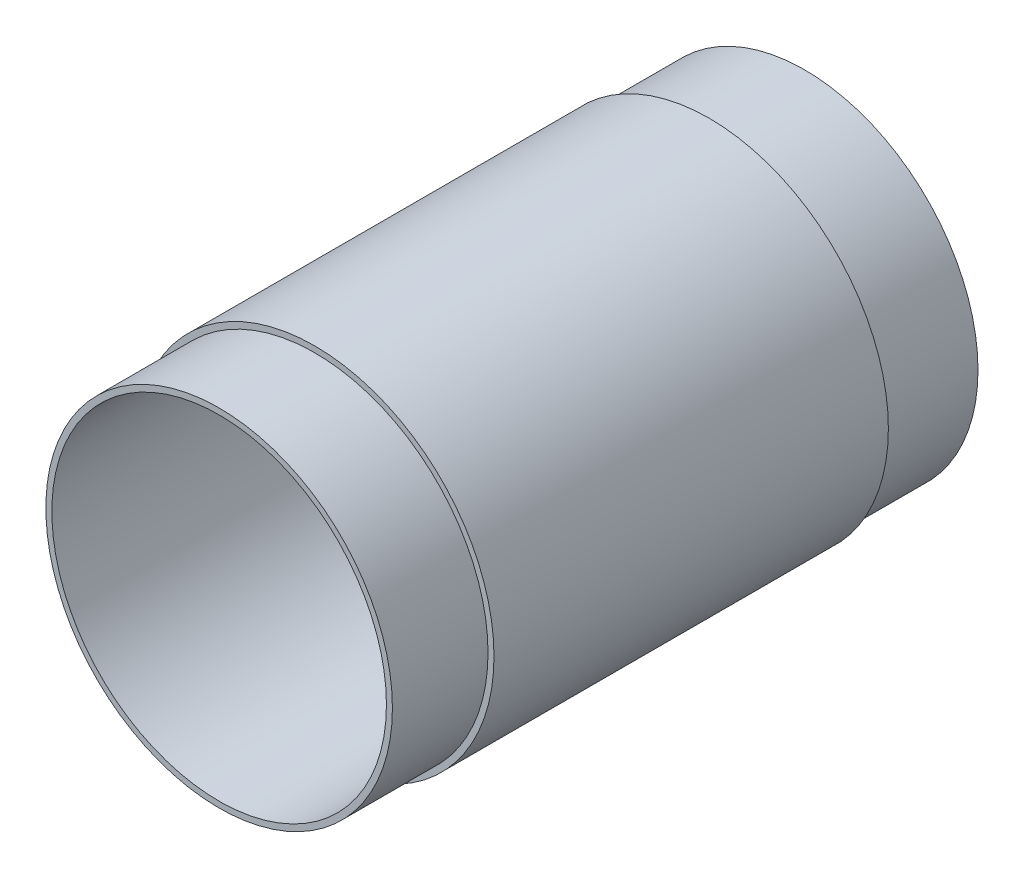
ISO-10303-21;
HEADER;
FILE_DESCRIPTION(('STEP AP214'),'2;1');
FILE_NAME('part.step','',(''),(''),'','','');
FILE_SCHEMA(('AUTOMOTIVE_DESIGN { 1 0 10303 214 1 1 1 1 }'));
ENDSEC;
DATA;
#1=APPLICATION_CONTEXT('core data for automotive mechanical design processes');
#2=APPLICATION_PROTOCOL_DEFINITION('international standard','automotive_design',2000,#1);
#3=PRODUCT_CONTEXT('',#1,'mechanical');
#4=PRODUCT('Part','Part','',(#3));
#5=PRODUCT_RELATED_PRODUCT_CATEGORY('part','',(#4));
#6=PRODUCT_DEFINITION_FORMATION('','',#4);
#7=PRODUCT_DEFINITION_CONTEXT('part definition',#1,'design');
#8=PRODUCT_DEFINITION('design','',#6,#7);
#9=PRODUCT_DEFINITION_SHAPE('','',#8);
#10=(LENGTH_UNIT() NAMED_UNIT(*) SI_UNIT(.MILLI.,.METRE.));
#11=(NAMED_UNIT(*) PLANE_ANGLE_UNIT() SI_UNIT($,.RADIAN.));
#12=(NAMED_UNIT(*) SI_UNIT($,.STERADIAN.) SOLID_ANGLE_UNIT());
#13=UNCERTAINTY_MEASURE_WITH_UNIT(LENGTH_MEASURE(1.E-05),#10,'distance_accuracy_value','');
#14=(GEOMETRIC_REPRESENTATION_CONTEXT(3) GLOBAL_UNCERTAINTY_ASSIGNED_CONTEXT((#13)) GLOBAL_UNIT_ASSIGNED_CONTEXT((#10,
#11,#12)) REPRESENTATION_CONTEXT('',''));
#15=CARTESIAN_POINT('',(0.,0.,0.));
#16=DIRECTION('',(0.,0.,1.));
#17=DIRECTION('',(1.,0.,0.));
#18=AXIS2_PLACEMENT_3D('',#15,#16,#17);
#19=CARTESIAN_POINT('',(0.,14.5,0.));
#20=DIRECTION('',(0.,0.,-1.));
#21=DIRECTION('',(-1.,0.,0.));
#22=AXIS2_PLACEMENT_3D('',#19,#20,#21);
#23=PLANE('',#22);
#24=CARTESIAN_POINT('',(0.,0.,0.));
#25=DIRECTION('',(0.,0.,1.));
#26=DIRECTION('',(1.,0.,0.));
#27=AXIS2_PLACEMENT_3D('',#24,#25,#26);
#28=CIRCLE('',#27,14.);
#29=CARTESIAN_POINT('',(14.,0.,0.));
#30=VERTEX_POINT('',#29);
#31=EDGE_CURVE('E10',#30,#30,#28,.T.);
#32=ORIENTED_EDGE('',*,*,#31,.F.);
#33=EDGE_LOOP('',(#32));
#34=FACE_BOUND('',#33,.T.);
#35=CARTESIAN_POINT('',(0.,0.,0.));
#36=DIRECTION('',(0.,0.,1.));
#37=DIRECTION('',(1.,0.,0.));
#38=AXIS2_PLACEMENT_3D('',#35,#36,#37);
#39=CIRCLE('',#38,14.5);
#40=CARTESIAN_POINT('',(14.5,0.,0.));
#41=VERTEX_POINT('',#40);
#42=EDGE_CURVE('E59',#41,#41,#39,.T.);
#43=ORIENTED_EDGE('',*,*,#42,.T.);
#44=EDGE_LOOP('',(#43));
#45=FACE_BOUND('',#44,.T.);
#46=ADVANCED_FACE('F31',(#34,#45),#23,.F.);
#47=CARTESIAN_POINT('',(0.,0.,0.));
#48=DIRECTION('',(0.,0.,1.));
#49=DIRECTION('',(1.,0.,0.));
#50=AXIS2_PLACEMENT_3D('',#47,#48,#49);
#51=CYLINDRICAL_SURFACE('',#50,14.);
#52=CARTESIAN_POINT('',(0.,0.,-49.));
#53=DIRECTION('',(0.,0.,1.));
#54=DIRECTION('',(1.,0.,0.));
#55=AXIS2_PLACEMENT_3D('',#52,#53,#54);
#56=CIRCLE('',#55,14.);
#57=CARTESIAN_POINT('',(14.,0.,-49.));
#58=VERTEX_POINT('',#57);
#59=EDGE_CURVE('E37',#58,#58,#56,.T.);
#60=ORIENTED_EDGE('',*,*,#59,.F.);
#61=EDGE_LOOP('',(#60));
#62=FACE_BOUND('',#61,.T.);
#63=ORIENTED_EDGE('',*,*,#31,.T.);
#64=EDGE_LOOP('',(#63));
#65=FACE_BOUND('',#64,.T.);
#66=ADVANCED_FACE('F96',(#62,#65),#51,.F.);
#67=CARTESIAN_POINT('',(0.,14.,-49.));
#68=DIRECTION('',(0.,0.,1.));
#69=DIRECTION('',(1.,0.,0.));
#70=AXIS2_PLACEMENT_3D('',#67,#68,#69);
#71=PLANE('',#70);
#72=CARTESIAN_POINT('',(0.,0.,-49.));
#73=DIRECTION('',(0.,0.,1.));
#74=DIRECTION('',(1.,0.,0.));
#75=AXIS2_PLACEMENT_3D('',#72,#73,#74);
#76=CIRCLE('',#75,14.5);
#77=CARTESIAN_POINT('',(14.5,0.,-49.));
#78=VERTEX_POINT('',#77);
#79=EDGE_CURVE('E41',#78,#78,#76,.T.);
#80=ORIENTED_EDGE('',*,*,#79,.F.);
#81=EDGE_LOOP('',(#80));
#82=FACE_BOUND('',#81,.T.);
#83=ORIENTED_EDGE('',*,*,#59,.T.);
#84=EDGE_LOOP('',(#83));
#85=FACE_BOUND('',#84,.T.);
#86=ADVANCED_FACE('F91',(#82,#85),#71,.F.);
#87=CARTESIAN_POINT('',(0.,0.,0.));
#88=DIRECTION('',(0.,0.,1.));
#89=DIRECTION('',(1.,0.,0.));
#90=AXIS2_PLACEMENT_3D('',#87,#88,#89);
#91=CYLINDRICAL_SURFACE('',#90,14.5);
#92=CARTESIAN_POINT('',(0.,0.,-41.));
#93=DIRECTION('',(0.,0.,1.));
#94=DIRECTION('',(1.,0.,0.));
#95=AXIS2_PLACEMENT_3D('',#92,#93,#94);
#96=CIRCLE('',#95,14.5);
#97=CARTESIAN_POINT('',(14.5,0.,-41.));
#98=VERTEX_POINT('',#97);
#99=EDGE_CURVE('E45',#98,#98,#96,.T.);
#100=ORIENTED_EDGE('',*,*,#99,.F.);
#101=EDGE_LOOP('',(#100));
#102=FACE_BOUND('',#101,.T.);
#103=ORIENTED_EDGE('',*,*,#79,.T.);
#104=EDGE_LOOP('',(#103));
#105=FACE_BOUND('',#104,.T.);
#106=ADVANCED_FACE('F85',(#102,#105),#91,.T.);
#107=CARTESIAN_POINT('',(0.,14.5,-41.));
#108=DIRECTION('',(0.,0.,1.));
#109=DIRECTION('',(1.,0.,0.));
#110=AXIS2_PLACEMENT_3D('',#107,#108,#109);
#111=PLANE('',#110);
#112=CARTESIAN_POINT('',(0.,0.,-41.));
#113=DIRECTION('',(0.,0.,1.));
#114=DIRECTION('',(1.,0.,0.));
#115=AXIS2_PLACEMENT_3D('',#112,#113,#114);
#116=CIRCLE('',#115,15.);
#117=CARTESIAN_POINT('',(15.,0.,-41.));
#118=VERTEX_POINT('',#117);
#119=EDGE_CURVE('E50',#118,#118,#116,.T.);
#120=ORIENTED_EDGE('',*,*,#119,.F.);
#121=EDGE_LOOP('',(#120));
#122=FACE_BOUND('',#121,.T.);
#123=ORIENTED_EDGE('',*,*,#99,.T.);
#124=EDGE_LOOP('',(#123));
#125=FACE_BOUND('',#124,.T.);
#126=ADVANCED_FACE('F79',(#122,#125),#111,.F.);
#127=CARTESIAN_POINT('',(0.,0.,0.));
#128=DIRECTION('',(0.,0.,1.));
#129=DIRECTION('',(1.,0.,0.));
#130=AXIS2_PLACEMENT_3D('',#127,#128,#129);
#131=CYLINDRICAL_SURFACE('',#130,15.);
#132=CARTESIAN_POINT('',(0.,0.,-8.));
#133=DIRECTION('',(0.,0.,1.));
#134=DIRECTION('',(1.,0.,0.));
#135=AXIS2_PLACEMENT_3D('',#132,#133,#134);
#136=CIRCLE('',#135,15.);
#137=CARTESIAN_POINT('',(15.,0.,-8.));
#138=VERTEX_POINT('',#137);
#139=EDGE_CURVE('E53',#138,#138,#136,.T.);
#140=ORIENTED_EDGE('',*,*,#139,.F.);
#141=EDGE_LOOP('',(#140));
#142=FACE_BOUND('',#141,.T.);
#143=ORIENTED_EDGE('',*,*,#119,.T.);
#144=EDGE_LOOP('',(#143));
#145=FACE_BOUND('',#144,.T.);
#146=ADVANCED_FACE('F73',(#142,#145),#131,.T.);
#147=CARTESIAN_POINT('',(0.,15.,-8.));
#148=DIRECTION('',(0.,0.,-1.));
#149=DIRECTION('',(-1.,0.,0.));
#150=AXIS2_PLACEMENT_3D('',#147,#148,#149);
#151=PLANE('',#150);
#152=CARTESIAN_POINT('',(0.,0.,-8.));
#153=DIRECTION('',(0.,0.,1.));
#154=DIRECTION('',(1.,0.,0.));
#155=AXIS2_PLACEMENT_3D('',#152,#153,#154);
#156=CIRCLE('',#155,14.5);
#157=CARTESIAN_POINT('',(14.5,0.,-8.));
#158=VERTEX_POINT('',#157);
#159=EDGE_CURVE('E56',#158,#158,#156,.T.);
#160=ORIENTED_EDGE('',*,*,#159,.F.);
#161=EDGE_LOOP('',(#160));
#162=FACE_BOUND('',#161,.T.);
#163=ORIENTED_EDGE('',*,*,#139,.T.);
#164=EDGE_LOOP('',(#163));
#165=FACE_BOUND('',#164,.T.);
#166=ADVANCED_FACE('F67',(#162,#165),#151,.F.);
#167=CARTESIAN_POINT('',(0.,0.,0.));
#168=DIRECTION('',(0.,0.,1.));
#169=DIRECTION('',(1.,0.,0.));
#170=AXIS2_PLACEMENT_3D('',#167,#168,#169);
#171=CYLINDRICAL_SURFACE('',#170,14.5);
#172=ORIENTED_EDGE('',*,*,#42,.F.);
#173=EDGE_LOOP('',(#172));
#174=FACE_BOUND('',#173,.T.);
#175=ORIENTED_EDGE('',*,*,#159,.T.);
#176=EDGE_LOOP('',(#175));
#177=FACE_BOUND('',#176,.T.);
#178=ADVANCED_FACE('F64',(#174,#177),#171,.T.);
#179=CLOSED_SHELL('',(#46,#66,#86,#106,#126,#146,#166,#178));
#180=MANIFOLD_SOLID_BREP('B2',#179);
#181=ADVANCED_BREP_SHAPE_REPRESENTATION('',(#18,#180),#14);
#182=SHAPE_DEFINITION_REPRESENTATION(#9,#181);
ENDSEC;
END-ISO-10303-21;
